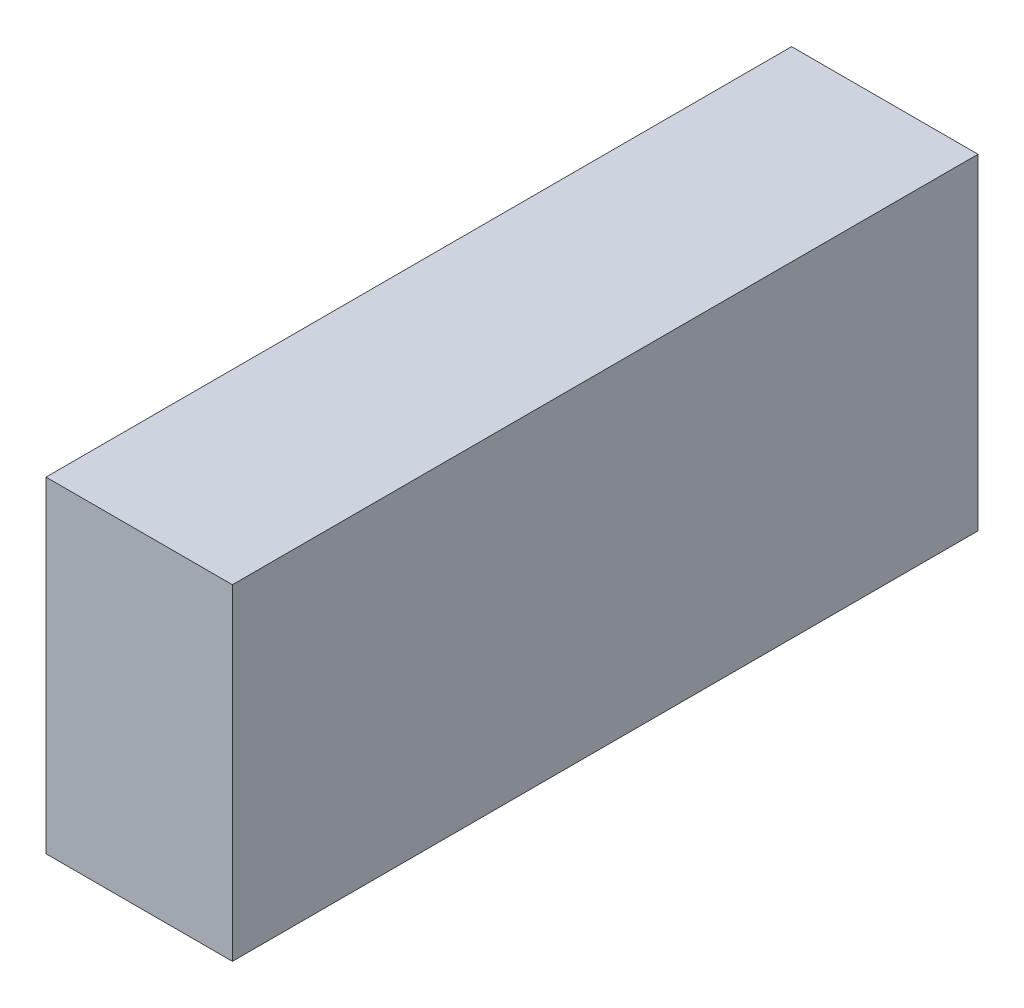
ISO-10303-21;
HEADER;
FILE_DESCRIPTION(('STEP AP214'),'2;1');
FILE_NAME('part.step','',(''),(''),'','','');
FILE_SCHEMA(('AUTOMOTIVE_DESIGN { 1 0 10303 214 1 1 1 1 }'));
ENDSEC;
DATA;
#1=APPLICATION_CONTEXT('core data for automotive mechanical design processes');
#2=APPLICATION_PROTOCOL_DEFINITION('international standard','automotive_design',2000,#1);
#3=PRODUCT_CONTEXT('',#1,'mechanical');
#4=PRODUCT('Part','Part','',(#3));
#5=PRODUCT_RELATED_PRODUCT_CATEGORY('part','',(#4));
#6=PRODUCT_DEFINITION_FORMATION('','',#4);
#7=PRODUCT_DEFINITION_CONTEXT('part definition',#1,'design');
#8=PRODUCT_DEFINITION('design','',#6,#7);
#9=PRODUCT_DEFINITION_SHAPE('','',#8);
#10=(LENGTH_UNIT() NAMED_UNIT(*) SI_UNIT(.MILLI.,.METRE.));
#11=(NAMED_UNIT(*) PLANE_ANGLE_UNIT() SI_UNIT($,.RADIAN.));
#12=(NAMED_UNIT(*) SI_UNIT($,.STERADIAN.) SOLID_ANGLE_UNIT());
#13=UNCERTAINTY_MEASURE_WITH_UNIT(LENGTH_MEASURE(1.E-05),#10,'distance_accuracy_value','');
#14=(GEOMETRIC_REPRESENTATION_CONTEXT(3) GLOBAL_UNCERTAINTY_ASSIGNED_CONTEXT((#13)) GLOBAL_UNIT_ASSIGNED_CONTEXT((#10,
#11,#12)) REPRESENTATION_CONTEXT('',''));
#15=CARTESIAN_POINT('',(0.,0.,0.));
#16=DIRECTION('',(0.,0.,1.));
#17=DIRECTION('',(1.,0.,0.));
#18=AXIS2_PLACEMENT_3D('',#15,#16,#17);
#19=CARTESIAN_POINT('',(0.508,-0.889,0.));
#20=DIRECTION('',(-1.,0.,0.));
#21=DIRECTION('',(0.,0.,1.));
#22=AXIS2_PLACEMENT_3D('',#19,#20,#21);
#23=PLANE('',#22);
#24=DIRECTION('',(0.,0.,-1.));
#25=VECTOR('',#24,1.);
#26=CARTESIAN_POINT('',(0.508,0.889,0.));
#27=LINE('',#26,#25);
#28=CARTESIAN_POINT('',(0.508,0.889,0.));
#29=VERTEX_POINT('',#28);
#30=CARTESIAN_POINT('',(0.508,0.889,4.064));
#31=VERTEX_POINT('',#30);
#32=EDGE_CURVE('E20',#29,#31,#27,.F.);
#33=ORIENTED_EDGE('',*,*,#32,.T.);
#34=DIRECTION('',(0.,1.,0.));
#35=VECTOR('',#34,1.);
#36=CARTESIAN_POINT('',(0.508,0.889,4.064));
#37=LINE('',#36,#35);
#38=CARTESIAN_POINT('',(0.508,-0.889,4.064));
#39=VERTEX_POINT('',#38);
#40=EDGE_CURVE('E55',#31,#39,#37,.F.);
#41=ORIENTED_EDGE('',*,*,#40,.T.);
#42=DIRECTION('',(0.,0.,1.));
#43=VECTOR('',#42,1.);
#44=CARTESIAN_POINT('',(0.508,-0.889,0.));
#45=LINE('',#44,#43);
#46=CARTESIAN_POINT('',(0.508,-0.889,0.));
#47=VERTEX_POINT('',#46);
#48=EDGE_CURVE('E76',#39,#47,#45,.F.);
#49=ORIENTED_EDGE('',*,*,#48,.T.);
#50=DIRECTION('',(0.,1.,0.));
#51=VECTOR('',#50,1.);
#52=CARTESIAN_POINT('',(0.508,0.889,0.));
#53=LINE('',#52,#51);
#54=EDGE_CURVE('E58',#29,#47,#53,.F.);
#55=ORIENTED_EDGE('',*,*,#54,.F.);
#56=EDGE_LOOP('',(#33,#41,#49,#55));
#57=FACE_BOUND('',#56,.T.);
#58=ADVANCED_FACE('F17',(#57),#23,.F.);
#59=CARTESIAN_POINT('',(0.508,0.889,0.));
#60=DIRECTION('',(0.,-1.,0.));
#61=DIRECTION('',(0.,0.,-1.));
#62=AXIS2_PLACEMENT_3D('',#59,#60,#61);
#63=PLANE('',#62);
#64=DIRECTION('',(0.,0.,-1.));
#65=VECTOR('',#64,1.);
#66=CARTESIAN_POINT('',(-0.508,0.889,0.));
#67=LINE('',#66,#65);
#68=CARTESIAN_POINT('',(-0.508,0.889,0.));
#69=VERTEX_POINT('',#68);
#70=CARTESIAN_POINT('',(-0.508,0.889,4.064));
#71=VERTEX_POINT('',#70);
#72=EDGE_CURVE('E73',#69,#71,#67,.F.);
#73=ORIENTED_EDGE('',*,*,#72,.T.);
#74=DIRECTION('',(-1.,0.,0.));
#75=VECTOR('',#74,1.);
#76=CARTESIAN_POINT('',(-0.508,0.889,4.064));
#77=LINE('',#76,#75);
#78=EDGE_CURVE('E63',#71,#31,#77,.F.);
#79=ORIENTED_EDGE('',*,*,#78,.T.);
#80=ORIENTED_EDGE('',*,*,#32,.F.);
#81=DIRECTION('',(-1.,0.,0.));
#82=VECTOR('',#81,1.);
#83=CARTESIAN_POINT('',(-0.508,0.889,0.));
#84=LINE('',#83,#82);
#85=EDGE_CURVE('E78',#69,#29,#84,.F.);
#86=ORIENTED_EDGE('',*,*,#85,.F.);
#87=EDGE_LOOP('',(#73,#79,#80,#86));
#88=FACE_BOUND('',#87,.T.);
#89=ADVANCED_FACE('F72',(#88),#63,.F.);
#90=CARTESIAN_POINT('',(-0.508,0.889,4.064));
#91=DIRECTION('',(0.,0.,-1.));
#92=DIRECTION('',(-1.,0.,0.));
#93=AXIS2_PLACEMENT_3D('',#90,#91,#92);
#94=PLANE('',#93);
#95=DIRECTION('',(1.,0.,0.));
#96=VECTOR('',#95,1.);
#97=CARTESIAN_POINT('',(-0.508,-0.889,4.064));
#98=LINE('',#97,#96);
#99=CARTESIAN_POINT('',(-0.508,-0.889,4.064));
#100=VERTEX_POINT('',#99);
#101=EDGE_CURVE('E69',#100,#39,#98,.T.);
#102=ORIENTED_EDGE('',*,*,#101,.T.);
#103=ORIENTED_EDGE('',*,*,#40,.F.);
#104=ORIENTED_EDGE('',*,*,#78,.F.);
#105=DIRECTION('',(0.,1.,0.));
#106=VECTOR('',#105,1.);
#107=CARTESIAN_POINT('',(-0.508,0.889,4.064));
#108=LINE('',#107,#106);
#109=EDGE_CURVE('E83',#71,#100,#108,.F.);
#110=ORIENTED_EDGE('',*,*,#109,.T.);
#111=EDGE_LOOP('',(#102,#103,#104,#110));
#112=FACE_BOUND('',#111,.T.);
#113=ADVANCED_FACE('F66',(#112),#94,.F.);
#114=CARTESIAN_POINT('',(-0.508,-0.889,0.));
#115=DIRECTION('',(0.,1.,0.));
#116=DIRECTION('',(0.,0.,1.));
#117=AXIS2_PLACEMENT_3D('',#114,#115,#116);
#118=PLANE('',#117);
#119=ORIENTED_EDGE('',*,*,#48,.F.);
#120=ORIENTED_EDGE('',*,*,#101,.F.);
#121=DIRECTION('',(0.,0.,-1.));
#122=VECTOR('',#121,1.);
#123=CARTESIAN_POINT('',(-0.508,-0.889,0.));
#124=LINE('',#123,#122);
#125=CARTESIAN_POINT('',(-0.508,-0.889,0.));
#126=VERTEX_POINT('',#125);
#127=EDGE_CURVE('E26',#100,#126,#124,.T.);
#128=ORIENTED_EDGE('',*,*,#127,.T.);
#129=DIRECTION('',(-1.,0.,0.));
#130=VECTOR('',#129,1.);
#131=CARTESIAN_POINT('',(-0.508,-0.889,0.));
#132=LINE('',#131,#130);
#133=EDGE_CURVE('E34',#47,#126,#132,.T.);
#134=ORIENTED_EDGE('',*,*,#133,.F.);
#135=EDGE_LOOP('',(#119,#120,#128,#134));
#136=FACE_BOUND('',#135,.T.);
#137=ADVANCED_FACE('F88',(#136),#118,.F.);
#138=CARTESIAN_POINT('',(-0.508,0.889,0.));
#139=DIRECTION('',(0.,0.,-1.));
#140=DIRECTION('',(-1.,0.,0.));
#141=AXIS2_PLACEMENT_3D('',#138,#139,#140);
#142=PLANE('',#141);
#143=ORIENTED_EDGE('',*,*,#133,.T.);
#144=DIRECTION('',(0.,1.,0.));
#145=VECTOR('',#144,1.);
#146=CARTESIAN_POINT('',(-0.508,0.889,0.));
#147=LINE('',#146,#145);
#148=EDGE_CURVE('E11',#126,#69,#147,.T.);
#149=ORIENTED_EDGE('',*,*,#148,.T.);
#150=ORIENTED_EDGE('',*,*,#85,.T.);
#151=ORIENTED_EDGE('',*,*,#54,.T.);
#152=EDGE_LOOP('',(#143,#149,#150,#151));
#153=FACE_BOUND('',#152,.T.);
#154=ADVANCED_FACE('F91',(#153),#142,.T.);
#155=CARTESIAN_POINT('',(-0.508,0.889,0.));
#156=DIRECTION('',(1.,0.,0.));
#157=DIRECTION('',(0.,0.,-1.));
#158=AXIS2_PLACEMENT_3D('',#155,#156,#157);
#159=PLANE('',#158);
#160=ORIENTED_EDGE('',*,*,#127,.F.);
#161=ORIENTED_EDGE('',*,*,#109,.F.);
#162=ORIENTED_EDGE('',*,*,#72,.F.);
#163=ORIENTED_EDGE('',*,*,#148,.F.);
#164=EDGE_LOOP('',(#160,#161,#162,#163));
#165=FACE_BOUND('',#164,.T.);
#166=ADVANCED_FACE('F90',(#165),#159,.F.);
#167=CLOSED_SHELL('',(#58,#89,#113,#137,#154,#166));
#168=MANIFOLD_SOLID_BREP('B1',#167);
#169=ADVANCED_BREP_SHAPE_REPRESENTATION('',(#18,#168),#14);
#170=SHAPE_DEFINITION_REPRESENTATION(#9,#169);
ENDSEC;
END-ISO-10303-21;
